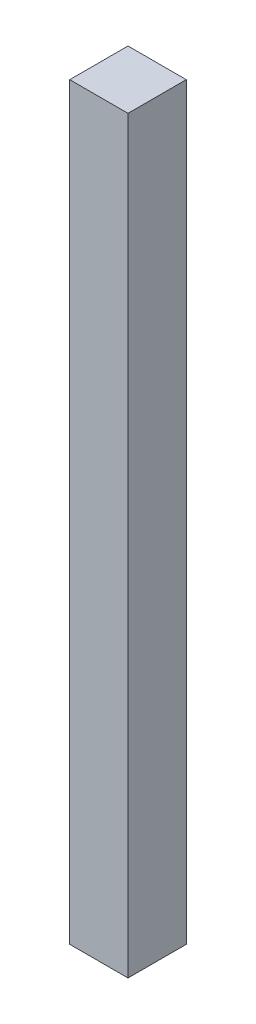
ISO-10303-21;
HEADER;
FILE_DESCRIPTION(('STEP AP214'),'2;1');
FILE_NAME('part.step','',(''),(''),'','','');
FILE_SCHEMA(('AUTOMOTIVE_DESIGN { 1 0 10303 214 1 1 1 1 }'));
ENDSEC;
DATA;
#1=APPLICATION_CONTEXT('core data for automotive mechanical design processes');
#2=APPLICATION_PROTOCOL_DEFINITION('international standard','automotive_design',2000,#1);
#3=PRODUCT_CONTEXT('',#1,'mechanical');
#4=PRODUCT('Part','Part','',(#3));
#5=PRODUCT_RELATED_PRODUCT_CATEGORY('part','',(#4));
#6=PRODUCT_DEFINITION_FORMATION('','',#4);
#7=PRODUCT_DEFINITION_CONTEXT('part definition',#1,'design');
#8=PRODUCT_DEFINITION('design','',#6,#7);
#9=PRODUCT_DEFINITION_SHAPE('','',#8);
#10=(LENGTH_UNIT() NAMED_UNIT(*) SI_UNIT(.MILLI.,.METRE.));
#11=(NAMED_UNIT(*) PLANE_ANGLE_UNIT() SI_UNIT($,.RADIAN.));
#12=(NAMED_UNIT(*) SI_UNIT($,.STERADIAN.) SOLID_ANGLE_UNIT());
#13=UNCERTAINTY_MEASURE_WITH_UNIT(LENGTH_MEASURE(1.E-05),#10,'distance_accuracy_value','');
#14=(GEOMETRIC_REPRESENTATION_CONTEXT(3) GLOBAL_UNCERTAINTY_ASSIGNED_CONTEXT((#13)) GLOBAL_UNIT_ASSIGNED_CONTEXT((#10,
#11,#12)) REPRESENTATION_CONTEXT('',''));
#15=CARTESIAN_POINT('',(0.,0.,0.));
#16=DIRECTION('',(0.,0.,1.));
#17=DIRECTION('',(1.,0.,0.));
#18=AXIS2_PLACEMENT_3D('',#15,#16,#17);
#19=CARTESIAN_POINT('',(-73.6499451754386,111.458333333333,13.));
#20=DIRECTION('',(1.,0.,0.));
#21=DIRECTION('',(0.,1.,0.));
#22=AXIS2_PLACEMENT_3D('',#19,#20,#21);
#23=PLANE('',#22);
#24=DIRECTION('',(0.,-1.,0.));
#25=VECTOR('',#24,1.);
#26=CARTESIAN_POINT('',(-73.6499451754386,111.458333333333,0.));
#27=LINE('',#26,#25);
#28=CARTESIAN_POINT('',(-73.6499451754386,111.458333333333,0.));
#29=VERTEX_POINT('',#28);
#30=CARTESIAN_POINT('',(-73.6499451754386,-55.5416666666667,0.));
#31=VERTEX_POINT('',#30);
#32=EDGE_CURVE('E96',#29,#31,#27,.T.);
#33=ORIENTED_EDGE('',*,*,#32,.T.);
#34=DIRECTION('',(0.,0.,-1.));
#35=VECTOR('',#34,1.);
#36=CARTESIAN_POINT('',(-73.6499451754386,-55.5416666666667,13.));
#37=LINE('',#36,#35);
#38=CARTESIAN_POINT('',(-73.6499451754386,-55.5416666666667,13.));
#39=VERTEX_POINT('',#38);
#40=EDGE_CURVE('E11',#39,#31,#37,.T.);
#41=ORIENTED_EDGE('',*,*,#40,.F.);
#42=DIRECTION('',(0.,-1.,0.));
#43=VECTOR('',#42,1.);
#44=CARTESIAN_POINT('',(-73.6499451754386,111.458333333333,13.));
#45=LINE('',#44,#43);
#46=CARTESIAN_POINT('',(-73.6499451754386,111.458333333333,13.));
#47=VERTEX_POINT('',#46);
#48=EDGE_CURVE('E84',#47,#39,#45,.T.);
#49=ORIENTED_EDGE('',*,*,#48,.F.);
#50=DIRECTION('',(0.,0.,-1.));
#51=VECTOR('',#50,1.);
#52=CARTESIAN_POINT('',(-73.6499451754386,111.458333333333,13.));
#53=LINE('',#52,#51);
#54=EDGE_CURVE('E92',#47,#29,#53,.T.);
#55=ORIENTED_EDGE('',*,*,#54,.T.);
#56=EDGE_LOOP('',(#33,#41,#49,#55));
#57=FACE_BOUND('',#56,.T.);
#58=ADVANCED_FACE('F33',(#57),#23,.F.);
#59=CARTESIAN_POINT('',(-73.6499451754386,-55.5416666666667,13.));
#60=DIRECTION('',(0.,1.,0.));
#61=DIRECTION('',(0.,0.,1.));
#62=AXIS2_PLACEMENT_3D('',#59,#60,#61);
#63=PLANE('',#62);
#64=DIRECTION('',(1.,0.,0.));
#65=VECTOR('',#64,1.);
#66=CARTESIAN_POINT('',(-73.6499451754386,-55.5416666666667,0.));
#67=LINE('',#66,#65);
#68=CARTESIAN_POINT('',(-60.6499451754386,-55.5416666666667,0.));
#69=VERTEX_POINT('',#68);
#70=EDGE_CURVE('E88',#31,#69,#67,.T.);
#71=ORIENTED_EDGE('',*,*,#70,.T.);
#72=DIRECTION('',(0.,0.,-1.));
#73=VECTOR('',#72,1.);
#74=CARTESIAN_POINT('',(-60.6499451754386,-55.5416666666667,13.));
#75=LINE('',#74,#73);
#76=CARTESIAN_POINT('',(-60.6499451754386,-55.5416666666667,13.));
#77=VERTEX_POINT('',#76);
#78=EDGE_CURVE('E41',#77,#69,#75,.T.);
#79=ORIENTED_EDGE('',*,*,#78,.F.);
#80=DIRECTION('',(1.,0.,0.));
#81=VECTOR('',#80,1.);
#82=CARTESIAN_POINT('',(-73.6499451754386,-55.5416666666667,13.));
#83=LINE('',#82,#81);
#84=EDGE_CURVE('E79',#39,#77,#83,.T.);
#85=ORIENTED_EDGE('',*,*,#84,.F.);
#86=ORIENTED_EDGE('',*,*,#40,.T.);
#87=EDGE_LOOP('',(#71,#79,#85,#86));
#88=FACE_BOUND('',#87,.T.);
#89=ADVANCED_FACE('F87',(#88),#63,.F.);
#90=CARTESIAN_POINT('',(-60.6499451754386,111.458333333333,13.));
#91=DIRECTION('',(-1.,0.,0.));
#92=DIRECTION('',(0.,-1.,0.));
#93=AXIS2_PLACEMENT_3D('',#90,#91,#92);
#94=PLANE('',#93);
#95=DIRECTION('',(0.,1.,0.));
#96=VECTOR('',#95,1.);
#97=CARTESIAN_POINT('',(-60.6499451754386,111.458333333333,0.));
#98=LINE('',#97,#96);
#99=CARTESIAN_POINT('',(-60.6499451754386,111.458333333333,0.));
#100=VERTEX_POINT('',#99);
#101=EDGE_CURVE('E66',#69,#100,#98,.T.);
#102=ORIENTED_EDGE('',*,*,#101,.T.);
#103=DIRECTION('',(0.,0.,-1.));
#104=VECTOR('',#103,1.);
#105=CARTESIAN_POINT('',(-60.6499451754386,111.458333333333,13.));
#106=LINE('',#105,#104);
#107=CARTESIAN_POINT('',(-60.6499451754386,111.458333333333,13.));
#108=VERTEX_POINT('',#107);
#109=EDGE_CURVE('E89',#108,#100,#106,.T.);
#110=ORIENTED_EDGE('',*,*,#109,.F.);
#111=DIRECTION('',(0.,1.,0.));
#112=VECTOR('',#111,1.);
#113=CARTESIAN_POINT('',(-60.6499451754386,111.458333333333,13.));
#114=LINE('',#113,#112);
#115=EDGE_CURVE('E82',#77,#108,#114,.T.);
#116=ORIENTED_EDGE('',*,*,#115,.F.);
#117=ORIENTED_EDGE('',*,*,#78,.T.);
#118=EDGE_LOOP('',(#102,#110,#116,#117));
#119=FACE_BOUND('',#118,.T.);
#120=ADVANCED_FACE('F90',(#119),#94,.F.);
#121=CARTESIAN_POINT('',(-73.6499451754386,111.458333333333,13.));
#122=DIRECTION('',(0.,-1.,0.));
#123=DIRECTION('',(0.,0.,-1.));
#124=AXIS2_PLACEMENT_3D('',#121,#122,#123);
#125=PLANE('',#124);
#126=DIRECTION('',(-1.,0.,0.));
#127=VECTOR('',#126,1.);
#128=CARTESIAN_POINT('',(-73.6499451754386,111.458333333333,0.));
#129=LINE('',#128,#127);
#130=EDGE_CURVE('E72',#100,#29,#129,.T.);
#131=ORIENTED_EDGE('',*,*,#130,.T.);
#132=ORIENTED_EDGE('',*,*,#54,.F.);
#133=DIRECTION('',(-1.,0.,0.));
#134=VECTOR('',#133,1.);
#135=CARTESIAN_POINT('',(-73.6499451754386,111.458333333333,13.));
#136=LINE('',#135,#134);
#137=EDGE_CURVE('E49',#108,#47,#136,.T.);
#138=ORIENTED_EDGE('',*,*,#137,.F.);
#139=ORIENTED_EDGE('',*,*,#109,.T.);
#140=EDGE_LOOP('',(#131,#132,#138,#139));
#141=FACE_BOUND('',#140,.T.);
#142=ADVANCED_FACE('F103',(#141),#125,.F.);
#143=CARTESIAN_POINT('',(0.,0.,13.));
#144=DIRECTION('',(0.,0.,1.));
#145=DIRECTION('',(1.,0.,0.));
#146=AXIS2_PLACEMENT_3D('',#143,#144,#145);
#147=PLANE('',#146);
#148=ORIENTED_EDGE('',*,*,#48,.T.);
#149=ORIENTED_EDGE('',*,*,#84,.T.);
#150=ORIENTED_EDGE('',*,*,#115,.T.);
#151=ORIENTED_EDGE('',*,*,#137,.T.);
#152=EDGE_LOOP('',(#148,#149,#150,#151));
#153=FACE_BOUND('',#152,.T.);
#154=ADVANCED_FACE('F80',(#153),#147,.T.);
#155=CARTESIAN_POINT('',(0.,0.,0.));
#156=DIRECTION('',(0.,0.,1.));
#157=DIRECTION('',(1.,0.,0.));
#158=AXIS2_PLACEMENT_3D('',#155,#156,#157);
#159=PLANE('',#158);
#160=ORIENTED_EDGE('',*,*,#32,.F.);
#161=ORIENTED_EDGE('',*,*,#130,.F.);
#162=ORIENTED_EDGE('',*,*,#101,.F.);
#163=ORIENTED_EDGE('',*,*,#70,.F.);
#164=EDGE_LOOP('',(#160,#161,#162,#163));
#165=FACE_BOUND('',#164,.T.);
#166=ADVANCED_FACE('F106',(#165),#159,.F.);
#167=CLOSED_SHELL('',(#58,#89,#120,#142,#154,#166));
#168=MANIFOLD_SOLID_BREP('B2',#167);
#169=ADVANCED_BREP_SHAPE_REPRESENTATION('',(#18,#168),#14);
#170=SHAPE_DEFINITION_REPRESENTATION(#9,#169);
ENDSEC;
END-ISO-10303-21;
